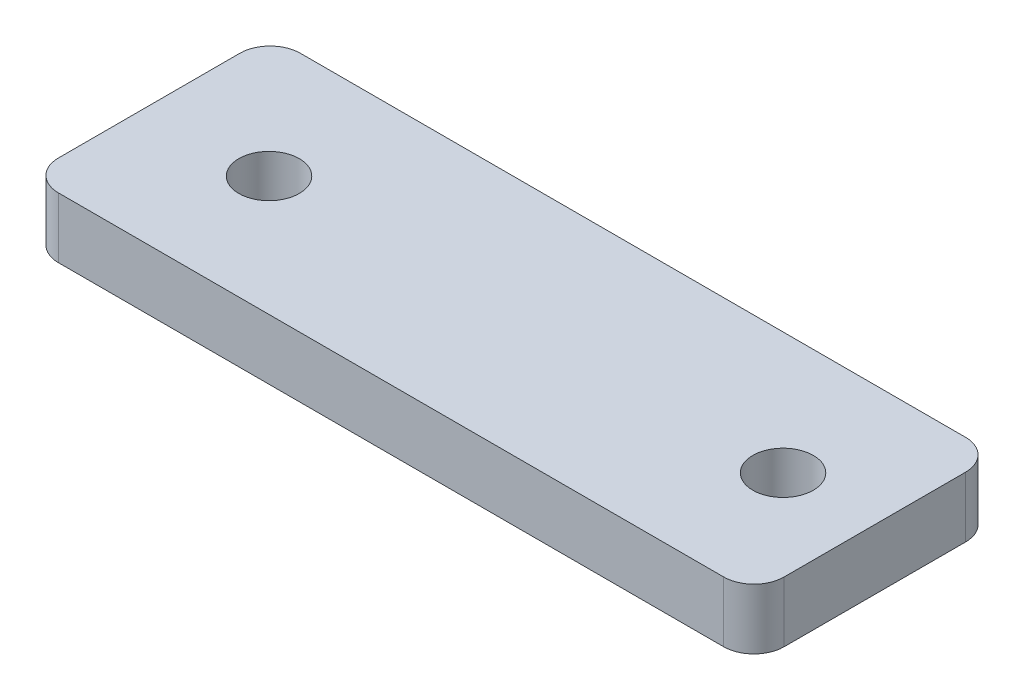
ISO-10303-21;
HEADER;
FILE_DESCRIPTION(('STEP AP214'),'2;1');
FILE_NAME('part.step','',(''),(''),'','','');
FILE_SCHEMA(('AUTOMOTIVE_DESIGN { 1 0 10303 214 1 1 1 1 }'));
ENDSEC;
DATA;
#1=APPLICATION_CONTEXT('core data for automotive mechanical design processes');
#2=APPLICATION_PROTOCOL_DEFINITION('international standard','automotive_design',2000,#1);
#3=PRODUCT_CONTEXT('',#1,'mechanical');
#4=PRODUCT('Part','Part','',(#3));
#5=PRODUCT_RELATED_PRODUCT_CATEGORY('part','',(#4));
#6=PRODUCT_DEFINITION_FORMATION('','',#4);
#7=PRODUCT_DEFINITION_CONTEXT('part definition',#1,'design');
#8=PRODUCT_DEFINITION('design','',#6,#7);
#9=PRODUCT_DEFINITION_SHAPE('','',#8);
#10=(LENGTH_UNIT() NAMED_UNIT(*) SI_UNIT(.MILLI.,.METRE.));
#11=(NAMED_UNIT(*) PLANE_ANGLE_UNIT() SI_UNIT($,.RADIAN.));
#12=(NAMED_UNIT(*) SI_UNIT($,.STERADIAN.) SOLID_ANGLE_UNIT());
#13=UNCERTAINTY_MEASURE_WITH_UNIT(LENGTH_MEASURE(1.E-05),#10,'distance_accuracy_value','');
#14=(GEOMETRIC_REPRESENTATION_CONTEXT(3) GLOBAL_UNCERTAINTY_ASSIGNED_CONTEXT((#13)) GLOBAL_UNIT_ASSIGNED_CONTEXT((#10,
#11,#12)) REPRESENTATION_CONTEXT('',''));
#15=CARTESIAN_POINT('',(0.,0.,0.));
#16=DIRECTION('',(0.,0.,1.));
#17=DIRECTION('',(1.,0.,0.));
#18=AXIS2_PLACEMENT_3D('',#15,#16,#17);
#19=CARTESIAN_POINT('',(69.1280016357688,10.,-10.4756352235551));
#20=DIRECTION('',(0.,1.,0.));
#21=DIRECTION('',(0.,0.,1.));
#22=AXIS2_PLACEMENT_3D('',#19,#20,#21);
#23=PLANE('',#22);
#24=CARTESIAN_POINT('',(-25.8719983642312,10.,4.70156215921483));
#25=DIRECTION('',(0.,1.,0.));
#26=DIRECTION('',(0.,0.,1.));
#27=AXIS2_PLACEMENT_3D('',#24,#25,#26);
#28=CIRCLE('',#27,5.);
#29=CARTESIAN_POINT('',(-25.8719983642312,10.,9.70156215921483));
#30=VERTEX_POINT('',#29);
#31=EDGE_CURVE('E146',#30,#30,#28,.T.);
#32=ORIENTED_EDGE('',*,*,#31,.F.);
#33=EDGE_LOOP('',(#32));
#34=FACE_BOUND('',#33,.T.);
#35=CARTESIAN_POINT('',(69.1280016357688,10.,-10.4756352235551));
#36=DIRECTION('',(0.,1.,0.));
#37=DIRECTION('',(0.,0.,1.));
#38=AXIS2_PLACEMENT_3D('',#35,#36,#37);
#39=CIRCLE('',#38,5.);
#40=CARTESIAN_POINT('',(74.1280016357688,10.,-10.4756352235551));
#41=VERTEX_POINT('',#40);
#42=CARTESIAN_POINT('',(69.1280016357688,10.,-15.4756352235551));
#43=VERTEX_POINT('',#42);
#44=EDGE_CURVE('E164',#41,#43,#39,.T.);
#45=ORIENTED_EDGE('',*,*,#44,.T.);
#46=DIRECTION('',(-1.,0.,0.));
#47=VECTOR('',#46,1.);
#48=CARTESIAN_POINT('',(-40.8719983642312,10.,-15.4756352235551));
#49=LINE('',#48,#47);
#50=CARTESIAN_POINT('',(-40.8719983642312,10.,-15.4756352235551));
#51=VERTEX_POINT('',#50);
#52=EDGE_CURVE('E100',#43,#51,#49,.T.);
#53=ORIENTED_EDGE('',*,*,#52,.T.);
#54=CARTESIAN_POINT('',(-40.8719983642312,10.,-10.4756352235551));
#55=DIRECTION('',(0.,1.,0.));
#56=DIRECTION('',(0.,0.,1.));
#57=AXIS2_PLACEMENT_3D('',#54,#55,#56);
#58=CIRCLE('',#57,5.);
#59=CARTESIAN_POINT('',(-45.8719983642312,10.,-10.4756352235551));
#60=VERTEX_POINT('',#59);
#61=EDGE_CURVE('E185',#51,#60,#58,.T.);
#62=ORIENTED_EDGE('',*,*,#61,.T.);
#63=DIRECTION('',(0.,0.,1.));
#64=VECTOR('',#63,1.);
#65=CARTESIAN_POINT('',(-45.8719983642312,10.,-10.4756352235551));
#66=LINE('',#65,#64);
#67=CARTESIAN_POINT('',(-45.8719983642312,10.,19.5243647764449));
#68=VERTEX_POINT('',#67);
#69=EDGE_CURVE('E199',#60,#68,#66,.T.);
#70=ORIENTED_EDGE('',*,*,#69,.T.);
#71=CARTESIAN_POINT('',(-40.8719983642312,10.,19.5243647764449));
#72=DIRECTION('',(0.,1.,0.));
#73=DIRECTION('',(0.,0.,-1.));
#74=AXIS2_PLACEMENT_3D('',#71,#72,#73);
#75=CIRCLE('',#74,5.);
#76=CARTESIAN_POINT('',(-40.8719983642312,10.,24.5243647764449));
#77=VERTEX_POINT('',#76);
#78=EDGE_CURVE('E119',#68,#77,#75,.T.);
#79=ORIENTED_EDGE('',*,*,#78,.T.);
#80=DIRECTION('',(1.,0.,0.));
#81=VECTOR('',#80,1.);
#82=CARTESIAN_POINT('',(-40.8719983642312,10.,24.5243647764449));
#83=LINE('',#82,#81);
#84=CARTESIAN_POINT('',(69.1280016357688,10.,24.5243647764449));
#85=VERTEX_POINT('',#84);
#86=EDGE_CURVE('E113',#77,#85,#83,.T.);
#87=ORIENTED_EDGE('',*,*,#86,.T.);
#88=CARTESIAN_POINT('',(69.1280016357688,10.,19.5243647764449));
#89=DIRECTION('',(0.,1.,0.));
#90=DIRECTION('',(0.,0.,-1.));
#91=AXIS2_PLACEMENT_3D('',#88,#89,#90);
#92=CIRCLE('',#91,4.99999999999999);
#93=CARTESIAN_POINT('',(74.1280016357688,10.,19.5243647764449));
#94=VERTEX_POINT('',#93);
#95=EDGE_CURVE('E117',#85,#94,#92,.T.);
#96=ORIENTED_EDGE('',*,*,#95,.T.);
#97=DIRECTION('',(0.,0.,-1.));
#98=VECTOR('',#97,1.);
#99=CARTESIAN_POINT('',(74.1280016357688,10.,-10.4756352235551));
#100=LINE('',#99,#98);
#101=EDGE_CURVE('E57',#94,#41,#100,.T.);
#102=ORIENTED_EDGE('',*,*,#101,.T.);
#103=EDGE_LOOP('',(#45,#53,#62,#70,#79,#87,#96,#102));
#104=FACE_BOUND('',#103,.T.);
#105=CARTESIAN_POINT('',(59.1280016357688,10.,4.70156215921478));
#106=DIRECTION('',(0.,1.,0.));
#107=DIRECTION('',(0.,0.,1.));
#108=AXIS2_PLACEMENT_3D('',#105,#106,#107);
#109=CIRCLE('',#108,5.);
#110=CARTESIAN_POINT('',(59.1280016357688,10.,9.70156215921478));
#111=VERTEX_POINT('',#110);
#112=EDGE_CURVE('E213',#111,#111,#109,.T.);
#113=ORIENTED_EDGE('',*,*,#112,.F.);
#114=EDGE_LOOP('',(#113));
#115=FACE_BOUND('',#114,.T.);
#116=ADVANCED_FACE('F39',(#34,#104,#115),#23,.T.);
#117=CARTESIAN_POINT('',(69.1280016357688,0.,-10.4756352235551));
#118=DIRECTION('',(0.,1.,0.));
#119=DIRECTION('',(0.,0.,1.));
#120=AXIS2_PLACEMENT_3D('',#117,#118,#119);
#121=PLANE('',#120);
#122=CARTESIAN_POINT('',(69.1280016357688,0.,-10.4756352235551));
#123=DIRECTION('',(0.,1.,0.));
#124=DIRECTION('',(0.,0.,1.));
#125=AXIS2_PLACEMENT_3D('',#122,#123,#124);
#126=CIRCLE('',#125,5.);
#127=CARTESIAN_POINT('',(74.1280016357688,0.,-10.4756352235551));
#128=VERTEX_POINT('',#127);
#129=CARTESIAN_POINT('',(69.1280016357688,0.,-15.4756352235551));
#130=VERTEX_POINT('',#129);
#131=EDGE_CURVE('E141',#128,#130,#126,.T.);
#132=ORIENTED_EDGE('',*,*,#131,.F.);
#133=DIRECTION('',(0.,0.,-1.));
#134=VECTOR('',#133,1.);
#135=CARTESIAN_POINT('',(74.1280016357688,0.,-10.4756352235551));
#136=LINE('',#135,#134);
#137=CARTESIAN_POINT('',(74.1280016357688,0.,19.5243647764449));
#138=VERTEX_POINT('',#137);
#139=EDGE_CURVE('E92',#138,#128,#136,.T.);
#140=ORIENTED_EDGE('',*,*,#139,.F.);
#141=CARTESIAN_POINT('',(69.1280016357688,0.,19.5243647764449));
#142=DIRECTION('',(0.,1.,0.));
#143=DIRECTION('',(0.,0.,-1.));
#144=AXIS2_PLACEMENT_3D('',#141,#142,#143);
#145=CIRCLE('',#144,4.99999999999999);
#146=CARTESIAN_POINT('',(69.1280016357688,0.,24.5243647764449));
#147=VERTEX_POINT('',#146);
#148=EDGE_CURVE('E86',#147,#138,#145,.T.);
#149=ORIENTED_EDGE('',*,*,#148,.F.);
#150=DIRECTION('',(1.,0.,0.));
#151=VECTOR('',#150,1.);
#152=CARTESIAN_POINT('',(-40.8719983642312,0.,24.5243647764449));
#153=LINE('',#152,#151);
#154=CARTESIAN_POINT('',(-40.8719983642312,0.,24.5243647764449));
#155=VERTEX_POINT('',#154);
#156=EDGE_CURVE('E128',#155,#147,#153,.T.);
#157=ORIENTED_EDGE('',*,*,#156,.F.);
#158=CARTESIAN_POINT('',(-40.8719983642312,0.,19.5243647764449));
#159=DIRECTION('',(0.,1.,0.));
#160=DIRECTION('',(0.,0.,-1.));
#161=AXIS2_PLACEMENT_3D('',#158,#159,#160);
#162=CIRCLE('',#161,5.);
#163=CARTESIAN_POINT('',(-45.8719983642312,0.,19.5243647764449));
#164=VERTEX_POINT('',#163);
#165=EDGE_CURVE('E155',#164,#155,#162,.T.);
#166=ORIENTED_EDGE('',*,*,#165,.F.);
#167=DIRECTION('',(0.,0.,1.));
#168=VECTOR('',#167,1.);
#169=CARTESIAN_POINT('',(-45.8719983642312,0.,-10.4756352235551));
#170=LINE('',#169,#168);
#171=CARTESIAN_POINT('',(-45.8719983642312,0.,-10.4756352235551));
#172=VERTEX_POINT('',#171);
#173=EDGE_CURVE('E152',#172,#164,#170,.T.);
#174=ORIENTED_EDGE('',*,*,#173,.F.);
#175=CARTESIAN_POINT('',(-40.8719983642312,0.,-10.4756352235551));
#176=DIRECTION('',(0.,1.,0.));
#177=DIRECTION('',(0.,0.,1.));
#178=AXIS2_PLACEMENT_3D('',#175,#176,#177);
#179=CIRCLE('',#178,5.);
#180=CARTESIAN_POINT('',(-40.8719983642312,0.,-15.4756352235551));
#181=VERTEX_POINT('',#180);
#182=EDGE_CURVE('E149',#181,#172,#179,.T.);
#183=ORIENTED_EDGE('',*,*,#182,.F.);
#184=DIRECTION('',(-1.,0.,0.));
#185=VECTOR('',#184,1.);
#186=CARTESIAN_POINT('',(-40.8719983642312,0.,-15.4756352235551));
#187=LINE('',#186,#185);
#188=EDGE_CURVE('E145',#130,#181,#187,.T.);
#189=ORIENTED_EDGE('',*,*,#188,.F.);
#190=EDGE_LOOP('',(#132,#140,#149,#157,#166,#174,#183,#189));
#191=FACE_BOUND('',#190,.T.);
#192=CARTESIAN_POINT('',(-25.8719983642312,0.,4.70156215921483));
#193=DIRECTION('',(0.,1.,0.));
#194=DIRECTION('',(0.,0.,1.));
#195=AXIS2_PLACEMENT_3D('',#192,#193,#194);
#196=CIRCLE('',#195,5.);
#197=CARTESIAN_POINT('',(-25.8719983642312,0.,9.70156215921483));
#198=VERTEX_POINT('',#197);
#199=EDGE_CURVE('E209',#198,#198,#196,.T.);
#200=ORIENTED_EDGE('',*,*,#199,.T.);
#201=EDGE_LOOP('',(#200));
#202=FACE_BOUND('',#201,.T.);
#203=CARTESIAN_POINT('',(59.1280016357688,0.,4.70156215921478));
#204=DIRECTION('',(0.,1.,0.));
#205=DIRECTION('',(0.,0.,1.));
#206=AXIS2_PLACEMENT_3D('',#203,#204,#205);
#207=CIRCLE('',#206,5.);
#208=CARTESIAN_POINT('',(59.1280016357688,0.,9.70156215921478));
#209=VERTEX_POINT('',#208);
#210=EDGE_CURVE('E217',#209,#209,#207,.T.);
#211=ORIENTED_EDGE('',*,*,#210,.T.);
#212=EDGE_LOOP('',(#211));
#213=FACE_BOUND('',#212,.T.);
#214=ADVANCED_FACE('F189',(#191,#202,#213),#121,.F.);
#215=CARTESIAN_POINT('',(69.1280016357688,10.,-10.4756352235551));
#216=DIRECTION('',(0.,-1.,0.));
#217=DIRECTION('',(0.,0.,-1.));
#218=AXIS2_PLACEMENT_3D('',#215,#216,#217);
#219=CYLINDRICAL_SURFACE('',#218,5.);
#220=ORIENTED_EDGE('',*,*,#131,.T.);
#221=DIRECTION('',(0.,-1.,0.));
#222=VECTOR('',#221,1.);
#223=CARTESIAN_POINT('',(69.1280016357688,10.,-15.4756352235551));
#224=LINE('',#223,#222);
#225=EDGE_CURVE('E11',#43,#130,#224,.T.);
#226=ORIENTED_EDGE('',*,*,#225,.F.);
#227=ORIENTED_EDGE('',*,*,#44,.F.);
#228=DIRECTION('',(0.,-1.,0.));
#229=VECTOR('',#228,1.);
#230=CARTESIAN_POINT('',(74.1280016357688,10.,-10.4756352235551));
#231=LINE('',#230,#229);
#232=EDGE_CURVE('E137',#41,#128,#231,.T.);
#233=ORIENTED_EDGE('',*,*,#232,.T.);
#234=EDGE_LOOP('',(#220,#226,#227,#233));
#235=FACE_BOUND('',#234,.T.);
#236=ADVANCED_FACE('F41',(#235),#219,.T.);
#237=CARTESIAN_POINT('',(-40.8719983642312,10.,-15.4756352235551));
#238=DIRECTION('',(0.,0.,1.));
#239=DIRECTION('',(1.,0.,0.));
#240=AXIS2_PLACEMENT_3D('',#237,#238,#239);
#241=PLANE('',#240);
#242=ORIENTED_EDGE('',*,*,#188,.T.);
#243=DIRECTION('',(0.,-1.,0.));
#244=VECTOR('',#243,1.);
#245=CARTESIAN_POINT('',(-40.8719983642312,10.,-15.4756352235551));
#246=LINE('',#245,#244);
#247=EDGE_CURVE('E49',#51,#181,#246,.T.);
#248=ORIENTED_EDGE('',*,*,#247,.F.);
#249=ORIENTED_EDGE('',*,*,#52,.F.);
#250=ORIENTED_EDGE('',*,*,#225,.T.);
#251=EDGE_LOOP('',(#242,#248,#249,#250));
#252=FACE_BOUND('',#251,.T.);
#253=ADVANCED_FACE('F251',(#252),#241,.F.);
#254=CARTESIAN_POINT('',(-40.8719983642312,10.,-10.4756352235551));
#255=DIRECTION('',(0.,-1.,0.));
#256=DIRECTION('',(0.,0.,-1.));
#257=AXIS2_PLACEMENT_3D('',#254,#255,#256);
#258=CYLINDRICAL_SURFACE('',#257,5.);
#259=ORIENTED_EDGE('',*,*,#182,.T.);
#260=DIRECTION('',(0.,-1.,0.));
#261=VECTOR('',#260,1.);
#262=CARTESIAN_POINT('',(-45.8719983642312,10.,-10.4756352235551));
#263=LINE('',#262,#261);
#264=EDGE_CURVE('E175',#60,#172,#263,.T.);
#265=ORIENTED_EDGE('',*,*,#264,.F.);
#266=ORIENTED_EDGE('',*,*,#61,.F.);
#267=ORIENTED_EDGE('',*,*,#247,.T.);
#268=EDGE_LOOP('',(#259,#265,#266,#267));
#269=FACE_BOUND('',#268,.T.);
#270=ADVANCED_FACE('F183',(#269),#258,.T.);
#271=CARTESIAN_POINT('',(-45.8719983642312,10.,-10.4756352235551));
#272=DIRECTION('',(1.,0.,0.));
#273=DIRECTION('',(0.,0.,-1.));
#274=AXIS2_PLACEMENT_3D('',#271,#272,#273);
#275=PLANE('',#274);
#276=ORIENTED_EDGE('',*,*,#173,.T.);
#277=DIRECTION('',(0.,-1.,0.));
#278=VECTOR('',#277,1.);
#279=CARTESIAN_POINT('',(-45.8719983642312,10.,19.5243647764449));
#280=LINE('',#279,#278);
#281=EDGE_CURVE('E171',#68,#164,#280,.T.);
#282=ORIENTED_EDGE('',*,*,#281,.F.);
#283=ORIENTED_EDGE('',*,*,#69,.F.);
#284=ORIENTED_EDGE('',*,*,#264,.T.);
#285=EDGE_LOOP('',(#276,#282,#283,#284));
#286=FACE_BOUND('',#285,.T.);
#287=ADVANCED_FACE('F194',(#286),#275,.F.);
#288=CARTESIAN_POINT('',(-40.8719983642312,10.,19.5243647764449));
#289=DIRECTION('',(0.,-1.,0.));
#290=DIRECTION('',(0.,0.,-1.));
#291=AXIS2_PLACEMENT_3D('',#288,#289,#290);
#292=CYLINDRICAL_SURFACE('',#291,5.);
#293=ORIENTED_EDGE('',*,*,#165,.T.);
#294=DIRECTION('',(0.,-1.,0.));
#295=VECTOR('',#294,1.);
#296=CARTESIAN_POINT('',(-40.8719983642312,10.,24.5243647764449));
#297=LINE('',#296,#295);
#298=EDGE_CURVE('E130',#77,#155,#297,.T.);
#299=ORIENTED_EDGE('',*,*,#298,.F.);
#300=ORIENTED_EDGE('',*,*,#78,.F.);
#301=ORIENTED_EDGE('',*,*,#281,.T.);
#302=EDGE_LOOP('',(#293,#299,#300,#301));
#303=FACE_BOUND('',#302,.T.);
#304=ADVANCED_FACE('F197',(#303),#292,.T.);
#305=CARTESIAN_POINT('',(-40.8719983642312,10.,24.5243647764449));
#306=DIRECTION('',(0.,0.,-1.));
#307=DIRECTION('',(-1.,0.,0.));
#308=AXIS2_PLACEMENT_3D('',#305,#306,#307);
#309=PLANE('',#308);
#310=ORIENTED_EDGE('',*,*,#156,.T.);
#311=DIRECTION('',(0.,-1.,0.));
#312=VECTOR('',#311,1.);
#313=CARTESIAN_POINT('',(69.1280016357688,10.,24.5243647764449));
#314=LINE('',#313,#312);
#315=EDGE_CURVE('E125',#85,#147,#314,.T.);
#316=ORIENTED_EDGE('',*,*,#315,.F.);
#317=ORIENTED_EDGE('',*,*,#86,.F.);
#318=ORIENTED_EDGE('',*,*,#298,.T.);
#319=EDGE_LOOP('',(#310,#316,#317,#318));
#320=FACE_BOUND('',#319,.T.);
#321=ADVANCED_FACE('F126',(#320),#309,.F.);
#322=CARTESIAN_POINT('',(69.1280016357688,10.,19.5243647764449));
#323=DIRECTION('',(0.,-1.,0.));
#324=DIRECTION('',(0.,0.,-1.));
#325=AXIS2_PLACEMENT_3D('',#322,#323,#324);
#326=CYLINDRICAL_SURFACE('',#325,4.99999999999999);
#327=ORIENTED_EDGE('',*,*,#148,.T.);
#328=DIRECTION('',(0.,-1.,0.));
#329=VECTOR('',#328,1.);
#330=CARTESIAN_POINT('',(74.1280016357688,10.,19.5243647764449));
#331=LINE('',#330,#329);
#332=EDGE_CURVE('E131',#94,#138,#331,.T.);
#333=ORIENTED_EDGE('',*,*,#332,.F.);
#334=ORIENTED_EDGE('',*,*,#95,.F.);
#335=ORIENTED_EDGE('',*,*,#315,.T.);
#336=EDGE_LOOP('',(#327,#333,#334,#335));
#337=FACE_BOUND('',#336,.T.);
#338=ADVANCED_FACE('F133',(#337),#326,.T.);
#339=CARTESIAN_POINT('',(74.1280016357688,10.,-10.4756352235551));
#340=DIRECTION('',(-1.,0.,0.));
#341=DIRECTION('',(0.,0.,1.));
#342=AXIS2_PLACEMENT_3D('',#339,#340,#341);
#343=PLANE('',#342);
#344=ORIENTED_EDGE('',*,*,#139,.T.);
#345=ORIENTED_EDGE('',*,*,#232,.F.);
#346=ORIENTED_EDGE('',*,*,#101,.F.);
#347=ORIENTED_EDGE('',*,*,#332,.T.);
#348=EDGE_LOOP('',(#344,#345,#346,#347));
#349=FACE_BOUND('',#348,.T.);
#350=ADVANCED_FACE('F239',(#349),#343,.F.);
#351=CARTESIAN_POINT('',(-25.8719983642312,10.,4.70156215921483));
#352=DIRECTION('',(0.,-1.,0.));
#353=DIRECTION('',(0.,0.,-1.));
#354=AXIS2_PLACEMENT_3D('',#351,#352,#353);
#355=CYLINDRICAL_SURFACE('',#354,5.);
#356=ORIENTED_EDGE('',*,*,#31,.T.);
#357=EDGE_LOOP('',(#356));
#358=FACE_BOUND('',#357,.T.);
#359=ORIENTED_EDGE('',*,*,#199,.F.);
#360=EDGE_LOOP('',(#359));
#361=FACE_BOUND('',#360,.T.);
#362=ADVANCED_FACE('F236',(#358,#361),#355,.F.);
#363=CARTESIAN_POINT('',(59.1280016357688,10.,4.70156215921478));
#364=DIRECTION('',(0.,-1.,0.));
#365=DIRECTION('',(0.,0.,-1.));
#366=AXIS2_PLACEMENT_3D('',#363,#364,#365);
#367=CYLINDRICAL_SURFACE('',#366,5.);
#368=ORIENTED_EDGE('',*,*,#112,.T.);
#369=EDGE_LOOP('',(#368));
#370=FACE_BOUND('',#369,.T.);
#371=ORIENTED_EDGE('',*,*,#210,.F.);
#372=EDGE_LOOP('',(#371));
#373=FACE_BOUND('',#372,.T.);
#374=ADVANCED_FACE('F225',(#370,#373),#367,.F.);
#375=CLOSED_SHELL('',(#116,#214,#236,#253,#270,#287,#304,#321,#338,#350,#362,#374));
#376=MANIFOLD_SOLID_BREP('B2',#375);
#377=ADVANCED_BREP_SHAPE_REPRESENTATION('',(#18,#376),#14);
#378=SHAPE_DEFINITION_REPRESENTATION(#9,#377);
ENDSEC;
END-ISO-10303-21;
